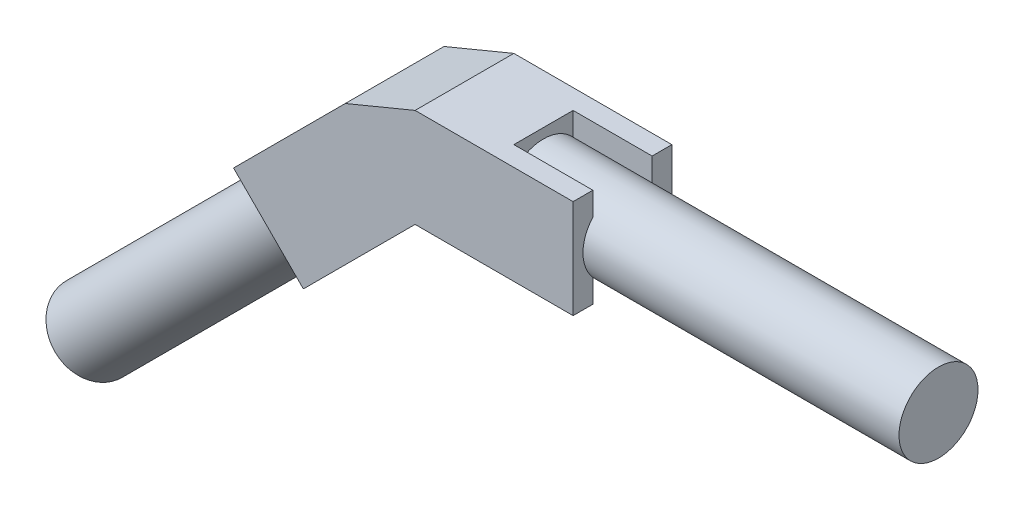
ISO-10303-21;
HEADER;
FILE_DESCRIPTION(('STEP AP214'),'2;1');
FILE_NAME('part.step','',(''),(''),'','','');
FILE_SCHEMA(('AUTOMOTIVE_DESIGN { 1 0 10303 214 1 1 1 1 }'));
ENDSEC;
DATA;
#1=APPLICATION_CONTEXT('core data for automotive mechanical design processes');
#2=APPLICATION_PROTOCOL_DEFINITION('international standard','automotive_design',2000,#1);
#3=PRODUCT_CONTEXT('',#1,'mechanical');
#4=PRODUCT('Part','Part','',(#3));
#5=PRODUCT_RELATED_PRODUCT_CATEGORY('part','',(#4));
#6=PRODUCT_DEFINITION_FORMATION('','',#4);
#7=PRODUCT_DEFINITION_CONTEXT('part definition',#1,'design');
#8=PRODUCT_DEFINITION('design','',#6,#7);
#9=PRODUCT_DEFINITION_SHAPE('','',#8);
#10=(LENGTH_UNIT() NAMED_UNIT(*) SI_UNIT(.MILLI.,.METRE.));
#11=(NAMED_UNIT(*) PLANE_ANGLE_UNIT() SI_UNIT($,.RADIAN.));
#12=(NAMED_UNIT(*) SI_UNIT($,.STERADIAN.) SOLID_ANGLE_UNIT());
#13=UNCERTAINTY_MEASURE_WITH_UNIT(LENGTH_MEASURE(1.E-05),#10,'distance_accuracy_value','');
#14=(GEOMETRIC_REPRESENTATION_CONTEXT(3) GLOBAL_UNCERTAINTY_ASSIGNED_CONTEXT((#13)) GLOBAL_UNIT_ASSIGNED_CONTEXT((#10,
#11,#12)) REPRESENTATION_CONTEXT('',''));
#15=CARTESIAN_POINT('',(0.,0.,0.));
#16=DIRECTION('',(0.,0.,1.));
#17=DIRECTION('',(1.,0.,0.));
#18=AXIS2_PLACEMENT_3D('',#15,#16,#17);
#19=CARTESIAN_POINT('',(0.,0.,0.));
#20=DIRECTION('',(-1.,0.,0.));
#21=DIRECTION('',(0.,0.,1.));
#22=AXIS2_PLACEMENT_3D('',#19,#20,#21);
#23=PLANE('',#22);
#24=DIRECTION('',(0.,0.,1.));
#25=VECTOR('',#24,1.);
#26=CARTESIAN_POINT('',(0.,-15.875,-15.875));
#27=LINE('',#26,#25);
#28=CARTESIAN_POINT('',(0.,-15.875,-9.525));
#29=VERTEX_POINT('',#28);
#30=CARTESIAN_POINT('',(0.,-15.875,9.525));
#31=VERTEX_POINT('',#30);
#32=EDGE_CURVE('E326',#29,#31,#27,.T.);
#33=ORIENTED_EDGE('',*,*,#32,.F.);
#34=DIRECTION('',(0.,1.,0.));
#35=VECTOR('',#34,1.);
#36=CARTESIAN_POINT('',(0.,15.875,-9.525));
#37=LINE('',#36,#35);
#38=CARTESIAN_POINT('',(0.,-8.40026041263008,-9.525));
#39=VERTEX_POINT('',#38);
#40=EDGE_CURVE('E269',#29,#39,#37,.T.);
#41=ORIENTED_EDGE('',*,*,#40,.T.);
#42=CARTESIAN_POINT('',(0.,0.,0.));
#43=DIRECTION('',(1.,0.,0.));
#44=DIRECTION('',(0.,0.,-1.));
#45=AXIS2_PLACEMENT_3D('',#42,#43,#44);
#46=CIRCLE('',#45,12.7);
#47=CARTESIAN_POINT('',(0.,-8.40026041263008,9.525));
#48=VERTEX_POINT('',#47);
#49=EDGE_CURVE('E343',#48,#39,#46,.T.);
#50=ORIENTED_EDGE('',*,*,#49,.F.);
#51=DIRECTION('',(0.,1.,0.));
#52=VECTOR('',#51,1.);
#53=CARTESIAN_POINT('',(0.,0.,9.525));
#54=LINE('',#53,#52);
#55=EDGE_CURVE('E342',#31,#48,#54,.T.);
#56=ORIENTED_EDGE('',*,*,#55,.F.);
#57=EDGE_LOOP('',(#33,#41,#50,#56));
#58=FACE_BOUND('',#57,.T.);
#59=ADVANCED_FACE('F39',(#58),#23,.F.);
#60=CARTESIAN_POINT('',(127.,0.,0.));
#61=DIRECTION('',(-1.,0.,0.));
#62=DIRECTION('',(0.,0.,1.));
#63=AXIS2_PLACEMENT_3D('',#60,#61,#62);
#64=CYLINDRICAL_SURFACE('',#63,12.7);
#65=CARTESIAN_POINT('',(127.,0.,0.));
#66=DIRECTION('',(1.,0.,0.));
#67=DIRECTION('',(0.,0.,-1.));
#68=AXIS2_PLACEMENT_3D('',#65,#66,#67);
#69=CIRCLE('',#68,12.7);
#70=CARTESIAN_POINT('',(127.,0.,-12.7));
#71=VERTEX_POINT('',#70);
#72=EDGE_CURVE('E339',#71,#71,#69,.T.);
#73=ORIENTED_EDGE('',*,*,#72,.F.);
#74=EDGE_LOOP('',(#73));
#75=FACE_BOUND('',#74,.T.);
#76=CARTESIAN_POINT('',(25.4,0.,0.));
#77=DIRECTION('',(1.,0.,0.));
#78=DIRECTION('',(0.,0.,-1.));
#79=AXIS2_PLACEMENT_3D('',#76,#77,#78);
#80=CIRCLE('',#79,12.7);
#81=CARTESIAN_POINT('',(25.4,-8.40026041263008,-9.525));
#82=VERTEX_POINT('',#81);
#83=CARTESIAN_POINT('',(25.4,8.40026041263007,-9.525));
#84=VERTEX_POINT('',#83);
#85=EDGE_CURVE('E11',#82,#84,#80,.T.);
#86=ORIENTED_EDGE('',*,*,#85,.T.);
#87=DIRECTION('',(-1.,0.,0.));
#88=VECTOR('',#87,1.);
#89=CARTESIAN_POINT('',(127.,8.40026041263007,-9.525));
#90=LINE('',#89,#88);
#91=CARTESIAN_POINT('',(0.,8.40026041263007,-9.525));
#92=VERTEX_POINT('',#91);
#93=EDGE_CURVE('E291',#84,#92,#90,.T.);
#94=ORIENTED_EDGE('',*,*,#93,.T.);
#95=CARTESIAN_POINT('',(0.,8.40026041263007,9.525));
#96=VERTEX_POINT('',#95);
#97=EDGE_CURVE('E338',#92,#96,#46,.T.);
#98=ORIENTED_EDGE('',*,*,#97,.T.);
#99=DIRECTION('',(-1.,0.,0.));
#100=VECTOR('',#99,1.);
#101=CARTESIAN_POINT('',(127.,8.40026041263007,9.525));
#102=LINE('',#101,#100);
#103=CARTESIAN_POINT('',(25.4,8.40026041263007,9.525));
#104=VERTEX_POINT('',#103);
#105=EDGE_CURVE('E318',#104,#96,#102,.T.);
#106=ORIENTED_EDGE('',*,*,#105,.F.);
#107=CARTESIAN_POINT('',(25.4,0.,0.));
#108=DIRECTION('',(1.,0.,0.));
#109=DIRECTION('',(0.,1.,0.));
#110=AXIS2_PLACEMENT_3D('',#107,#108,#109);
#111=CIRCLE('',#110,12.7);
#112=CARTESIAN_POINT('',(25.4,-8.40026041263008,9.525));
#113=VERTEX_POINT('',#112);
#114=EDGE_CURVE('E47',#104,#113,#111,.T.);
#115=ORIENTED_EDGE('',*,*,#114,.T.);
#116=DIRECTION('',(-1.,0.,0.));
#117=VECTOR('',#116,1.);
#118=CARTESIAN_POINT('',(127.,-8.40026041263007,9.525));
#119=LINE('',#118,#117);
#120=EDGE_CURVE('E314',#48,#113,#119,.F.);
#121=ORIENTED_EDGE('',*,*,#120,.F.);
#122=ORIENTED_EDGE('',*,*,#49,.T.);
#123=DIRECTION('',(-1.,0.,0.));
#124=VECTOR('',#123,1.);
#125=CARTESIAN_POINT('',(127.,-8.40026041263007,-9.525));
#126=LINE('',#125,#124);
#127=EDGE_CURVE('E286',#39,#82,#126,.F.);
#128=ORIENTED_EDGE('',*,*,#127,.T.);
#129=EDGE_LOOP('',(#86,#94,#98,#106,#115,#121,#122,#128));
#130=FACE_BOUND('',#129,.T.);
#131=ADVANCED_FACE('F41',(#75,#130),#64,.T.);
#132=ORIENTED_EDGE('',*,*,#97,.F.);
#133=CARTESIAN_POINT('',(0.,15.875,-9.525));
#134=VERTEX_POINT('',#133);
#135=EDGE_CURVE('E273',#92,#134,#37,.T.);
#136=ORIENTED_EDGE('',*,*,#135,.T.);
#137=DIRECTION('',(0.,0.,-1.));
#138=VECTOR('',#137,1.);
#139=CARTESIAN_POINT('',(0.,15.875,-15.875));
#140=LINE('',#139,#138);
#141=CARTESIAN_POINT('',(0.,15.875,9.525));
#142=VERTEX_POINT('',#141);
#143=EDGE_CURVE('E321',#142,#134,#140,.T.);
#144=ORIENTED_EDGE('',*,*,#143,.F.);
#145=DIRECTION('',(0.,-1.,0.));
#146=VECTOR('',#145,1.);
#147=CARTESIAN_POINT('',(0.,15.875,9.525));
#148=LINE('',#147,#146);
#149=EDGE_CURVE('E295',#142,#96,#148,.T.);
#150=ORIENTED_EDGE('',*,*,#149,.T.);
#151=EDGE_LOOP('',(#132,#136,#144,#150));
#152=FACE_BOUND('',#151,.T.);
#153=ADVANCED_FACE('F365',(#152),#23,.F.);
#154=CARTESIAN_POINT('',(127.,0.,0.));
#155=DIRECTION('',(1.,0.,0.));
#156=DIRECTION('',(0.,0.,-1.));
#157=AXIS2_PLACEMENT_3D('',#154,#155,#156);
#158=PLANE('',#157);
#159=ORIENTED_EDGE('',*,*,#72,.T.);
#160=EDGE_LOOP('',(#159));
#161=FACE_BOUND('',#160,.T.);
#162=ADVANCED_FACE('F397',(#161),#158,.T.);
#163=CARTESIAN_POINT('',(-25.4,15.875,15.875));
#164=DIRECTION('',(0.,0.,-1.));
#165=DIRECTION('',(-1.,0.,0.));
#166=AXIS2_PLACEMENT_3D('',#163,#164,#165);
#167=PLANE('',#166);
#168=DIRECTION('',(1.,0.,0.));
#169=VECTOR('',#168,1.);
#170=CARTESIAN_POINT('',(-25.4,-15.875,15.875));
#171=LINE('',#170,#169);
#172=CARTESIAN_POINT('',(-25.4,-15.875,15.875));
#173=VERTEX_POINT('',#172);
#174=CARTESIAN_POINT('',(25.4,-15.875,15.875));
#175=VERTEX_POINT('',#174);
#176=EDGE_CURVE('E328',#173,#175,#171,.T.);
#177=ORIENTED_EDGE('',*,*,#176,.T.);
#178=DIRECTION('',(0.,1.,0.));
#179=VECTOR('',#178,1.);
#180=CARTESIAN_POINT('',(25.4,15.875,15.875));
#181=LINE('',#180,#179);
#182=CARTESIAN_POINT('',(25.4,15.875,15.875));
#183=VERTEX_POINT('',#182);
#184=EDGE_CURVE('E294',#175,#183,#181,.T.);
#185=ORIENTED_EDGE('',*,*,#184,.T.);
#186=DIRECTION('',(1.,0.,0.));
#187=VECTOR('',#186,1.);
#188=CARTESIAN_POINT('',(-25.4,15.875,15.875));
#189=LINE('',#188,#187);
#190=CARTESIAN_POINT('',(-25.4,15.875,15.875));
#191=VERTEX_POINT('',#190);
#192=EDGE_CURVE('E336',#191,#183,#189,.T.);
#193=ORIENTED_EDGE('',*,*,#192,.F.);
#194=DIRECTION('',(0.923879532511286,0.382683432365091,0.));
#195=VECTOR('',#194,1.);
#196=CARTESIAN_POINT('',(-25.4,15.875,15.875));
#197=LINE('',#196,#195);
#198=CARTESIAN_POINT('',(-47.8506403026729,6.57564030267284,15.875));
#199=VERTEX_POINT('',#198);
#200=EDGE_CURVE('E260',#199,#191,#197,.T.);
#201=ORIENTED_EDGE('',*,*,#200,.F.);
#202=DIRECTION('',(0.707106781186546,0.707106781186549,0.));
#203=VECTOR('',#202,1.);
#204=CARTESIAN_POINT('',(-65.8111525448112,-11.3848719394655,15.875));
#205=LINE('',#204,#203);
#206=CARTESIAN_POINT('',(-83.7716647869495,-29.3453841816038,15.875));
#207=VERTEX_POINT('',#206);
#208=EDGE_CURVE('E227',#207,#199,#205,.T.);
#209=ORIENTED_EDGE('',*,*,#208,.F.);
#210=DIRECTION('',(0.707106781186547,-0.707106781186548,0.));
#211=VECTOR('',#210,1.);
#212=CARTESIAN_POINT('',(-61.3210244842766,-51.7960244842767,15.875));
#213=LINE('',#212,#211);
#214=CARTESIAN_POINT('',(-61.3210244842766,-51.7960244842767,15.875));
#215=VERTEX_POINT('',#214);
#216=EDGE_CURVE('E791',#207,#215,#213,.T.);
#217=ORIENTED_EDGE('',*,*,#216,.T.);
#218=DIRECTION('',(0.707106781186546,0.707106781186549,0.));
#219=VECTOR('',#218,1.);
#220=CARTESIAN_POINT('',(-43.3605122421383,-33.8355122421383,15.875));
#221=LINE('',#220,#219);
#222=EDGE_CURVE('E236',#215,#173,#221,.T.);
#223=ORIENTED_EDGE('',*,*,#222,.T.);
#224=EDGE_LOOP('',(#177,#185,#193,#201,#209,#217,#223));
#225=FACE_BOUND('',#224,.T.);
#226=ADVANCED_FACE('F401',(#225),#167,.F.);
#227=CARTESIAN_POINT('',(-25.4,15.875,-15.875));
#228=DIRECTION('',(0.,-1.,0.));
#229=DIRECTION('',(0.,0.,-1.));
#230=AXIS2_PLACEMENT_3D('',#227,#228,#229);
#231=PLANE('',#230);
#232=ORIENTED_EDGE('',*,*,#192,.T.);
#233=DIRECTION('',(0.,0.,1.));
#234=VECTOR('',#233,1.);
#235=CARTESIAN_POINT('',(25.4,15.875,9.525));
#236=LINE('',#235,#234);
#237=CARTESIAN_POINT('',(25.4,15.875,9.525));
#238=VERTEX_POINT('',#237);
#239=EDGE_CURVE('E311',#238,#183,#236,.T.);
#240=ORIENTED_EDGE('',*,*,#239,.F.);
#241=DIRECTION('',(-1.,0.,0.));
#242=VECTOR('',#241,1.);
#243=CARTESIAN_POINT('',(0.,15.875,9.525));
#244=LINE('',#243,#242);
#245=EDGE_CURVE('E305',#238,#142,#244,.T.);
#246=ORIENTED_EDGE('',*,*,#245,.T.);
#247=ORIENTED_EDGE('',*,*,#143,.T.);
#248=DIRECTION('',(1.,0.,0.));
#249=VECTOR('',#248,1.);
#250=CARTESIAN_POINT('',(0.,15.875,-9.525));
#251=LINE('',#250,#249);
#252=CARTESIAN_POINT('',(25.4,15.875,-9.525));
#253=VERTEX_POINT('',#252);
#254=EDGE_CURVE('E272',#134,#253,#251,.T.);
#255=ORIENTED_EDGE('',*,*,#254,.T.);
#256=DIRECTION('',(0.,0.,-1.));
#257=VECTOR('',#256,1.);
#258=CARTESIAN_POINT('',(25.4,15.875,-9.525));
#259=LINE('',#258,#257);
#260=CARTESIAN_POINT('',(25.4,15.875,-15.875));
#261=VERTEX_POINT('',#260);
#262=EDGE_CURVE('E281',#253,#261,#259,.T.);
#263=ORIENTED_EDGE('',*,*,#262,.T.);
#264=DIRECTION('',(1.,0.,0.));
#265=VECTOR('',#264,1.);
#266=CARTESIAN_POINT('',(-25.4,15.875,-15.875));
#267=LINE('',#266,#265);
#268=CARTESIAN_POINT('',(-25.4,15.875,-15.875));
#269=VERTEX_POINT('',#268);
#270=EDGE_CURVE('E334',#269,#261,#267,.T.);
#271=ORIENTED_EDGE('',*,*,#270,.F.);
#272=DIRECTION('',(0.,0.,-1.));
#273=VECTOR('',#272,1.);
#274=CARTESIAN_POINT('',(-25.4,15.875,-15.875));
#275=LINE('',#274,#273);
#276=EDGE_CURVE('E322',#191,#269,#275,.T.);
#277=ORIENTED_EDGE('',*,*,#276,.F.);
#278=EDGE_LOOP('',(#232,#240,#246,#247,#255,#263,#271,#277));
#279=FACE_BOUND('',#278,.T.);
#280=ADVANCED_FACE('F361',(#279),#231,.F.);
#281=CARTESIAN_POINT('',(-25.4,15.875,-15.875));
#282=DIRECTION('',(0.,0.,1.));
#283=DIRECTION('',(1.,0.,0.));
#284=AXIS2_PLACEMENT_3D('',#281,#282,#283);
#285=PLANE('',#284);
#286=ORIENTED_EDGE('',*,*,#270,.T.);
#287=DIRECTION('',(0.,-1.,0.));
#288=VECTOR('',#287,1.);
#289=CARTESIAN_POINT('',(25.4,15.875,-15.875));
#290=LINE('',#289,#288);
#291=CARTESIAN_POINT('',(25.4,-15.875,-15.875));
#292=VERTEX_POINT('',#291);
#293=EDGE_CURVE('E268',#261,#292,#290,.T.);
#294=ORIENTED_EDGE('',*,*,#293,.T.);
#295=DIRECTION('',(1.,0.,0.));
#296=VECTOR('',#295,1.);
#297=CARTESIAN_POINT('',(-25.4,-15.875,-15.875));
#298=LINE('',#297,#296);
#299=CARTESIAN_POINT('',(-25.4,-15.875,-15.875));
#300=VERTEX_POINT('',#299);
#301=EDGE_CURVE('E62',#300,#292,#298,.T.);
#302=ORIENTED_EDGE('',*,*,#301,.F.);
#303=DIRECTION('',(0.707106781186546,0.707106781186549,0.));
#304=VECTOR('',#303,1.);
#305=CARTESIAN_POINT('',(-43.3605122421383,-33.8355122421383,-15.875));
#306=LINE('',#305,#304);
#307=CARTESIAN_POINT('',(-61.3210244842766,-51.7960244842767,-15.875));
#308=VERTEX_POINT('',#307);
#309=EDGE_CURVE('E233',#308,#300,#306,.T.);
#310=ORIENTED_EDGE('',*,*,#309,.F.);
#311=DIRECTION('',(-0.707106781186547,0.707106781186548,0.));
#312=VECTOR('',#311,1.);
#313=CARTESIAN_POINT('',(-83.7716647869495,-29.3453841816038,-15.875));
#314=LINE('',#313,#312);
#315=CARTESIAN_POINT('',(-83.7716647869495,-29.3453841816038,-15.875));
#316=VERTEX_POINT('',#315);
#317=EDGE_CURVE('E215',#308,#316,#314,.T.);
#318=ORIENTED_EDGE('',*,*,#317,.T.);
#319=DIRECTION('',(0.707106781186546,0.707106781186549,0.));
#320=VECTOR('',#319,1.);
#321=CARTESIAN_POINT('',(-65.8111525448112,-11.3848719394655,-15.875));
#322=LINE('',#321,#320);
#323=CARTESIAN_POINT('',(-47.8506403026729,6.57564030267284,-15.875));
#324=VERTEX_POINT('',#323);
#325=EDGE_CURVE('E223',#316,#324,#322,.T.);
#326=ORIENTED_EDGE('',*,*,#325,.T.);
#327=DIRECTION('',(0.923879532511286,0.382683432365091,0.));
#328=VECTOR('',#327,1.);
#329=CARTESIAN_POINT('',(-25.4,15.875,-15.875));
#330=LINE('',#329,#328);
#331=EDGE_CURVE('E259',#324,#269,#330,.T.);
#332=ORIENTED_EDGE('',*,*,#331,.T.);
#333=EDGE_LOOP('',(#286,#294,#302,#310,#318,#326,#332));
#334=FACE_BOUND('',#333,.T.);
#335=ADVANCED_FACE('F411',(#334),#285,.F.);
#336=CARTESIAN_POINT('',(-25.4,-15.875,-15.875));
#337=DIRECTION('',(0.,1.,0.));
#338=DIRECTION('',(0.,0.,1.));
#339=AXIS2_PLACEMENT_3D('',#336,#337,#338);
#340=PLANE('',#339);
#341=ORIENTED_EDGE('',*,*,#301,.T.);
#342=DIRECTION('',(0.,0.,-1.));
#343=VECTOR('',#342,1.);
#344=CARTESIAN_POINT('',(25.4,-15.875,-9.525));
#345=LINE('',#344,#343);
#346=CARTESIAN_POINT('',(25.4,-15.875,-9.525));
#347=VERTEX_POINT('',#346);
#348=EDGE_CURVE('E283',#347,#292,#345,.T.);
#349=ORIENTED_EDGE('',*,*,#348,.F.);
#350=DIRECTION('',(-1.,0.,0.));
#351=VECTOR('',#350,1.);
#352=CARTESIAN_POINT('',(0.,-15.875,-9.525));
#353=LINE('',#352,#351);
#354=EDGE_CURVE('E54',#347,#29,#353,.T.);
#355=ORIENTED_EDGE('',*,*,#354,.T.);
#356=ORIENTED_EDGE('',*,*,#32,.T.);
#357=DIRECTION('',(1.,0.,0.));
#358=VECTOR('',#357,1.);
#359=CARTESIAN_POINT('',(0.,-15.875,9.525));
#360=LINE('',#359,#358);
#361=CARTESIAN_POINT('',(25.4,-15.875,9.525));
#362=VERTEX_POINT('',#361);
#363=EDGE_CURVE('E298',#31,#362,#360,.T.);
#364=ORIENTED_EDGE('',*,*,#363,.T.);
#365=DIRECTION('',(0.,0.,1.));
#366=VECTOR('',#365,1.);
#367=CARTESIAN_POINT('',(25.4,-15.875,9.525));
#368=LINE('',#367,#366);
#369=EDGE_CURVE('E308',#362,#175,#368,.T.);
#370=ORIENTED_EDGE('',*,*,#369,.T.);
#371=ORIENTED_EDGE('',*,*,#176,.F.);
#372=DIRECTION('',(0.,0.,1.));
#373=VECTOR('',#372,1.);
#374=CARTESIAN_POINT('',(-25.4,-15.875,-15.875));
#375=LINE('',#374,#373);
#376=EDGE_CURVE('E325',#300,#173,#375,.T.);
#377=ORIENTED_EDGE('',*,*,#376,.F.);
#378=EDGE_LOOP('',(#341,#349,#355,#356,#364,#370,#371,#377));
#379=FACE_BOUND('',#378,.T.);
#380=ADVANCED_FACE('F378',(#379),#340,.F.);
#381=CARTESIAN_POINT('',(0.,0.,9.525));
#382=DIRECTION('',(0.,0.,1.));
#383=DIRECTION('',(1.,0.,0.));
#384=AXIS2_PLACEMENT_3D('',#381,#382,#383);
#385=PLANE('',#384);
#386=DIRECTION('',(0.,1.,0.));
#387=VECTOR('',#386,1.);
#388=CARTESIAN_POINT('',(25.4,15.875,9.525));
#389=LINE('',#388,#387);
#390=EDGE_CURVE('E301',#104,#238,#389,.T.);
#391=ORIENTED_EDGE('',*,*,#390,.F.);
#392=ORIENTED_EDGE('',*,*,#105,.T.);
#393=ORIENTED_EDGE('',*,*,#149,.F.);
#394=ORIENTED_EDGE('',*,*,#245,.F.);
#395=EDGE_LOOP('',(#391,#392,#393,#394));
#396=FACE_BOUND('',#395,.T.);
#397=ADVANCED_FACE('F358',(#396),#385,.F.);
#398=ORIENTED_EDGE('',*,*,#55,.T.);
#399=ORIENTED_EDGE('',*,*,#120,.T.);
#400=EDGE_CURVE('E302',#362,#113,#389,.T.);
#401=ORIENTED_EDGE('',*,*,#400,.F.);
#402=ORIENTED_EDGE('',*,*,#363,.F.);
#403=EDGE_LOOP('',(#398,#399,#401,#402));
#404=FACE_BOUND('',#403,.T.);
#405=ADVANCED_FACE('F380',(#404),#385,.F.);
#406=CARTESIAN_POINT('',(25.4,15.875,9.525));
#407=DIRECTION('',(1.,0.,0.));
#408=DIRECTION('',(0.,1.,0.));
#409=AXIS2_PLACEMENT_3D('',#406,#407,#408);
#410=PLANE('',#409);
#411=ORIENTED_EDGE('',*,*,#114,.F.);
#412=ORIENTED_EDGE('',*,*,#390,.T.);
#413=ORIENTED_EDGE('',*,*,#239,.T.);
#414=ORIENTED_EDGE('',*,*,#184,.F.);
#415=ORIENTED_EDGE('',*,*,#369,.F.);
#416=ORIENTED_EDGE('',*,*,#400,.T.);
#417=EDGE_LOOP('',(#411,#412,#413,#414,#415,#416));
#418=FACE_BOUND('',#417,.T.);
#419=ADVANCED_FACE('F353',(#418),#410,.T.);
#420=CARTESIAN_POINT('',(0.,0.,-9.525));
#421=DIRECTION('',(0.,0.,1.));
#422=DIRECTION('',(1.,0.,0.));
#423=AXIS2_PLACEMENT_3D('',#420,#421,#422);
#424=PLANE('',#423);
#425=ORIENTED_EDGE('',*,*,#93,.F.);
#426=DIRECTION('',(0.,-1.,0.));
#427=VECTOR('',#426,1.);
#428=CARTESIAN_POINT('',(25.4,15.875,-9.525));
#429=LINE('',#428,#427);
#430=EDGE_CURVE('E277',#253,#84,#429,.T.);
#431=ORIENTED_EDGE('',*,*,#430,.F.);
#432=ORIENTED_EDGE('',*,*,#254,.F.);
#433=ORIENTED_EDGE('',*,*,#135,.F.);
#434=EDGE_LOOP('',(#425,#431,#432,#433));
#435=FACE_BOUND('',#434,.T.);
#436=ADVANCED_FACE('F367',(#435),#424,.T.);
#437=ORIENTED_EDGE('',*,*,#127,.F.);
#438=ORIENTED_EDGE('',*,*,#40,.F.);
#439=ORIENTED_EDGE('',*,*,#354,.F.);
#440=EDGE_CURVE('E276',#82,#347,#429,.T.);
#441=ORIENTED_EDGE('',*,*,#440,.F.);
#442=EDGE_LOOP('',(#437,#438,#439,#441));
#443=FACE_BOUND('',#442,.T.);
#444=ADVANCED_FACE('F373',(#443),#424,.T.);
#445=CARTESIAN_POINT('',(25.4,15.875,-9.525));
#446=DIRECTION('',(1.,0.,0.));
#447=DIRECTION('',(0.,0.,-1.));
#448=AXIS2_PLACEMENT_3D('',#445,#446,#447);
#449=PLANE('',#448);
#450=ORIENTED_EDGE('',*,*,#85,.F.);
#451=ORIENTED_EDGE('',*,*,#440,.T.);
#452=ORIENTED_EDGE('',*,*,#348,.T.);
#453=ORIENTED_EDGE('',*,*,#293,.F.);
#454=ORIENTED_EDGE('',*,*,#262,.F.);
#455=ORIENTED_EDGE('',*,*,#430,.T.);
#456=EDGE_LOOP('',(#450,#451,#452,#453,#454,#455));
#457=FACE_BOUND('',#456,.T.);
#458=ADVANCED_FACE('F371',(#457),#449,.T.);
#459=CARTESIAN_POINT('',(-25.4,15.875,15.875));
#460=DIRECTION('',(-0.382683432365091,0.923879532511286,0.));
#461=DIRECTION('',(-0.923879532511287,-0.382683432365091,0.));
#462=AXIS2_PLACEMENT_3D('',#459,#460,#461);
#463=PLANE('',#462);
#464=ORIENTED_EDGE('',*,*,#331,.F.);
#465=DIRECTION('',(0.,0.,-1.));
#466=VECTOR('',#465,1.);
#467=CARTESIAN_POINT('',(-47.8506403026729,6.57564030267284,15.875));
#468=LINE('',#467,#466);
#469=EDGE_CURVE('E263',#199,#324,#468,.T.);
#470=ORIENTED_EDGE('',*,*,#469,.F.);
#471=ORIENTED_EDGE('',*,*,#200,.T.);
#472=ORIENTED_EDGE('',*,*,#276,.T.);
#473=EDGE_LOOP('',(#464,#470,#471,#472));
#474=FACE_BOUND('',#473,.T.);
#475=ADVANCED_FACE('F459',(#474),#463,.T.);
#476=CARTESIAN_POINT('',(-38.5980122421382,-38.5980122421384,0.));
#477=DIRECTION('',(0.707106781186546,0.707106781186549,0.));
#478=DIRECTION('',(-0.707106781186549,0.707106781186546,0.));
#479=AXIS2_PLACEMENT_3D('',#476,#477,#478);
#480=PLANE('',#479);
#481=DIRECTION('',(0.,0.,1.));
#482=VECTOR('',#481,1.);
#483=CARTESIAN_POINT('',(-65.8111525448112,-11.3848719394655,-15.875));
#484=LINE('',#483,#482);
#485=CARTESIAN_POINT('',(-65.8111525448112,-11.3848719394655,-9.525));
#486=VERTEX_POINT('',#485);
#487=CARTESIAN_POINT('',(-65.8111525448112,-11.3848719394655,9.525));
#488=VERTEX_POINT('',#487);
#489=EDGE_CURVE('E224',#486,#488,#484,.T.);
#490=ORIENTED_EDGE('',*,*,#489,.F.);
#491=DIRECTION('',(0.707106781186549,-0.707106781186546,0.));
#492=VECTOR('',#491,1.);
#493=CARTESIAN_POINT('',(-43.3605122421383,-33.8355122421383,-9.525));
#494=LINE('',#493,#492);
#495=CARTESIAN_POINT('',(-60.5257134949784,-16.6703109892983,-9.525));
#496=VERTEX_POINT('',#495);
#497=EDGE_CURVE('E206',#486,#496,#494,.T.);
#498=ORIENTED_EDGE('',*,*,#497,.T.);
#499=CARTESIAN_POINT('',(-54.5858323934747,-22.6101920908019,0.));
#500=DIRECTION('',(-0.707106781186546,-0.707106781186549,0.));
#501=DIRECTION('',(0.707106781186549,-0.707106781186546,0.));
#502=AXIS2_PLACEMENT_3D('',#499,#500,#501);
#503=CIRCLE('',#502,12.7);
#504=CARTESIAN_POINT('',(-60.5257134949784,-16.6703109892983,9.525));
#505=VERTEX_POINT('',#504);
#506=EDGE_CURVE('E245',#505,#496,#503,.T.);
#507=ORIENTED_EDGE('',*,*,#506,.F.);
#508=DIRECTION('',(-0.707106781186549,0.707106781186546,0.));
#509=VECTOR('',#508,1.);
#510=CARTESIAN_POINT('',(-65.8111525448112,-11.3848719394655,9.525));
#511=LINE('',#510,#509);
#512=EDGE_CURVE('E796',#505,#488,#511,.T.);
#513=ORIENTED_EDGE('',*,*,#512,.T.);
#514=EDGE_LOOP('',(#490,#498,#507,#513));
#515=FACE_BOUND('',#514,.T.);
#516=ADVANCED_FACE('F468',(#515),#480,.F.);
#517=CARTESIAN_POINT('',(-43.3605122421383,-33.8355122421383,-15.875));
#518=DIRECTION('',(-0.707106781186549,0.707106781186546,0.));
#519=DIRECTION('',(-0.707106781186546,-0.707106781186549,0.));
#520=AXIS2_PLACEMENT_3D('',#517,#518,#519);
#521=PLANE('',#520);
#522=ORIENTED_EDGE('',*,*,#376,.T.);
#523=ORIENTED_EDGE('',*,*,#222,.F.);
#524=DIRECTION('',(0.,0.,1.));
#525=VECTOR('',#524,1.);
#526=CARTESIAN_POINT('',(-61.3210244842766,-51.7960244842767,9.525));
#527=LINE('',#526,#525);
#528=CARTESIAN_POINT('',(-61.3210244842766,-51.7960244842767,9.525));
#529=VERTEX_POINT('',#528);
#530=EDGE_CURVE('E807',#529,#215,#527,.T.);
#531=ORIENTED_EDGE('',*,*,#530,.F.);
#532=DIRECTION('',(0.707106781186548,0.707106781186548,0.));
#533=VECTOR('',#532,1.);
#534=CARTESIAN_POINT('',(-43.3605122421383,-33.8355122421383,9.525));
#535=LINE('',#534,#533);
#536=CARTESIAN_POINT('',(-43.3605122421383,-33.8355122421383,9.525));
#537=VERTEX_POINT('',#536);
#538=EDGE_CURVE('E222',#529,#537,#535,.T.);
#539=ORIENTED_EDGE('',*,*,#538,.T.);
#540=DIRECTION('',(0.,0.,1.));
#541=VECTOR('',#540,1.);
#542=CARTESIAN_POINT('',(-43.3605122421383,-33.8355122421383,-15.875));
#543=LINE('',#542,#541);
#544=CARTESIAN_POINT('',(-43.3605122421383,-33.8355122421383,-9.525));
#545=VERTEX_POINT('',#544);
#546=EDGE_CURVE('E212',#545,#537,#543,.T.);
#547=ORIENTED_EDGE('',*,*,#546,.F.);
#548=DIRECTION('',(-0.707106781186548,-0.707106781186548,0.));
#549=VECTOR('',#548,1.);
#550=CARTESIAN_POINT('',(-61.3210244842766,-51.7960244842767,-9.525));
#551=LINE('',#550,#549);
#552=CARTESIAN_POINT('',(-61.3210244842766,-51.7960244842767,-9.525));
#553=VERTEX_POINT('',#552);
#554=EDGE_CURVE('E195',#545,#553,#551,.T.);
#555=ORIENTED_EDGE('',*,*,#554,.T.);
#556=DIRECTION('',(0.,0.,-1.));
#557=VECTOR('',#556,1.);
#558=CARTESIAN_POINT('',(-61.3210244842766,-51.7960244842767,-9.525));
#559=LINE('',#558,#557);
#560=EDGE_CURVE('E786',#553,#308,#559,.T.);
#561=ORIENTED_EDGE('',*,*,#560,.T.);
#562=ORIENTED_EDGE('',*,*,#309,.T.);
#563=EDGE_LOOP('',(#522,#523,#531,#539,#547,#555,#561,#562));
#564=FACE_BOUND('',#563,.T.);
#565=ADVANCED_FACE('F219',(#564),#521,.F.);
#566=CARTESIAN_POINT('',(-65.8111525448112,-11.3848719394655,-15.875));
#567=DIRECTION('',(-0.707106781186549,0.707106781186546,0.));
#568=DIRECTION('',(-0.707106781186546,-0.707106781186549,0.));
#569=AXIS2_PLACEMENT_3D('',#566,#567,#568);
#570=PLANE('',#569);
#571=ORIENTED_EDGE('',*,*,#469,.T.);
#572=ORIENTED_EDGE('',*,*,#325,.F.);
#573=DIRECTION('',(0.,0.,-1.));
#574=VECTOR('',#573,1.);
#575=CARTESIAN_POINT('',(-83.7716647869495,-29.3453841816038,-9.525));
#576=LINE('',#575,#574);
#577=CARTESIAN_POINT('',(-83.7716647869495,-29.3453841816038,-9.525));
#578=VERTEX_POINT('',#577);
#579=EDGE_CURVE('E789',#578,#316,#576,.T.);
#580=ORIENTED_EDGE('',*,*,#579,.F.);
#581=DIRECTION('',(0.707106781186547,0.707106781186548,0.));
#582=VECTOR('',#581,1.);
#583=CARTESIAN_POINT('',(-65.8111525448112,-11.3848719394655,-9.525));
#584=LINE('',#583,#582);
#585=EDGE_CURVE('E784',#578,#486,#584,.T.);
#586=ORIENTED_EDGE('',*,*,#585,.T.);
#587=ORIENTED_EDGE('',*,*,#489,.T.);
#588=DIRECTION('',(-0.707106781186547,-0.707106781186548,0.));
#589=VECTOR('',#588,1.);
#590=CARTESIAN_POINT('',(-83.7716647869495,-29.3453841816038,9.525));
#591=LINE('',#590,#589);
#592=CARTESIAN_POINT('',(-83.7716647869495,-29.3453841816038,9.525));
#593=VERTEX_POINT('',#592);
#594=EDGE_CURVE('E795',#488,#593,#591,.T.);
#595=ORIENTED_EDGE('',*,*,#594,.T.);
#596=DIRECTION('',(0.,0.,1.));
#597=VECTOR('',#596,1.);
#598=CARTESIAN_POINT('',(-83.7716647869495,-29.3453841816038,9.525));
#599=LINE('',#598,#597);
#600=EDGE_CURVE('E804',#593,#207,#599,.T.);
#601=ORIENTED_EDGE('',*,*,#600,.T.);
#602=ORIENTED_EDGE('',*,*,#208,.T.);
#603=EDGE_LOOP('',(#571,#572,#580,#586,#587,#595,#601,#602));
#604=FACE_BOUND('',#603,.T.);
#605=ADVANCED_FACE('F487',(#604),#570,.T.);
#606=CARTESIAN_POINT('',(-48.6459512919711,-28.5500731923056,-9.525));
#607=VERTEX_POINT('',#606);
#608=CARTESIAN_POINT('',(-48.6459512919711,-28.5500731923056,9.525));
#609=VERTEX_POINT('',#608);
#610=EDGE_CURVE('E214',#607,#609,#503,.T.);
#611=ORIENTED_EDGE('',*,*,#610,.F.);
#612=EDGE_CURVE('E198',#607,#545,#494,.T.);
#613=ORIENTED_EDGE('',*,*,#612,.T.);
#614=ORIENTED_EDGE('',*,*,#546,.T.);
#615=EDGE_CURVE('E793',#537,#609,#511,.T.);
#616=ORIENTED_EDGE('',*,*,#615,.T.);
#617=EDGE_LOOP('',(#611,#613,#614,#616));
#618=FACE_BOUND('',#617,.T.);
#619=ADVANCED_FACE('F210',(#618),#480,.F.);
#620=CARTESIAN_POINT('',(-144.388393604166,-112.412753301494,0.));
#621=DIRECTION('',(0.707106781186546,0.707106781186549,0.));
#622=DIRECTION('',(-0.707106781186549,0.707106781186546,0.));
#623=AXIS2_PLACEMENT_3D('',#620,#621,#622);
#624=CYLINDRICAL_SURFACE('',#623,12.7);
#625=CARTESIAN_POINT('',(-144.388393604166,-112.412753301494,0.));
#626=DIRECTION('',(-0.707106781186546,-0.707106781186549,0.));
#627=DIRECTION('',(0.707106781186549,-0.707106781186546,0.));
#628=AXIS2_PLACEMENT_3D('',#625,#626,#627);
#629=CIRCLE('',#628,12.7);
#630=CARTESIAN_POINT('',(-135.408137483097,-121.393009422563,0.));
#631=VERTEX_POINT('',#630);
#632=EDGE_CURVE('E229',#631,#631,#629,.T.);
#633=ORIENTED_EDGE('',*,*,#632,.F.);
#634=EDGE_LOOP('',(#633));
#635=FACE_BOUND('',#634,.T.);
#636=CARTESIAN_POINT('',(-72.546344635613,-40.5707043329403,0.));
#637=DIRECTION('',(-0.707106781186548,-0.707106781186547,0.));
#638=DIRECTION('',(0.707106781186547,-0.707106781186548,0.));
#639=AXIS2_PLACEMENT_3D('',#636,#637,#638);
#640=CIRCLE('',#639,12.7);
#641=CARTESIAN_POINT('',(-78.4862257371166,-34.6308232314366,-9.525));
#642=VERTEX_POINT('',#641);
#643=CARTESIAN_POINT('',(-66.6064635341094,-46.5105854344439,-9.525));
#644=VERTEX_POINT('',#643);
#645=EDGE_CURVE('E254',#642,#644,#640,.T.);
#646=ORIENTED_EDGE('',*,*,#645,.T.);
#647=DIRECTION('',(0.707106781186546,0.707106781186549,0.));
#648=VECTOR('',#647,1.);
#649=CARTESIAN_POINT('',(-138.448512502662,-118.352634402997,-9.525));
#650=LINE('',#649,#648);
#651=EDGE_CURVE('E257',#644,#607,#650,.T.);
#652=ORIENTED_EDGE('',*,*,#651,.T.);
#653=ORIENTED_EDGE('',*,*,#610,.T.);
#654=DIRECTION('',(0.707106781186546,0.707106781186549,0.));
#655=VECTOR('',#654,1.);
#656=CARTESIAN_POINT('',(-138.448512502662,-118.352634402997,9.525));
#657=LINE('',#656,#655);
#658=CARTESIAN_POINT('',(-66.6064635341093,-46.5105854344439,9.525));
#659=VERTEX_POINT('',#658);
#660=EDGE_CURVE('E241',#609,#659,#657,.F.);
#661=ORIENTED_EDGE('',*,*,#660,.T.);
#662=CARTESIAN_POINT('',(-72.546344635613,-40.5707043329403,0.));
#663=DIRECTION('',(-0.707106781186548,-0.707106781186547,0.));
#664=DIRECTION('',(0.707106781186547,-0.707106781186548,0.));
#665=AXIS2_PLACEMENT_3D('',#662,#663,#664);
#666=CIRCLE('',#665,12.7);
#667=CARTESIAN_POINT('',(-78.4862257371166,-34.6308232314366,9.525));
#668=VERTEX_POINT('',#667);
#669=EDGE_CURVE('E244',#659,#668,#666,.T.);
#670=ORIENTED_EDGE('',*,*,#669,.T.);
#671=DIRECTION('',(0.707106781186546,0.707106781186549,0.));
#672=VECTOR('',#671,1.);
#673=CARTESIAN_POINT('',(-150.32827470567,-106.47287219999,9.525));
#674=LINE('',#673,#672);
#675=EDGE_CURVE('E248',#668,#505,#674,.T.);
#676=ORIENTED_EDGE('',*,*,#675,.T.);
#677=ORIENTED_EDGE('',*,*,#506,.T.);
#678=DIRECTION('',(0.707106781186546,0.707106781186549,0.));
#679=VECTOR('',#678,1.);
#680=CARTESIAN_POINT('',(-150.32827470567,-106.47287219999,-9.525));
#681=LINE('',#680,#679);
#682=EDGE_CURVE('E251',#496,#642,#681,.F.);
#683=ORIENTED_EDGE('',*,*,#682,.T.);
#684=EDGE_LOOP('',(#646,#652,#653,#661,#670,#676,#677,#683));
#685=FACE_BOUND('',#684,.T.);
#686=ADVANCED_FACE('F505',(#635,#685),#624,.T.);
#687=CARTESIAN_POINT('',(-144.388393604166,-112.412753301494,0.));
#688=DIRECTION('',(-0.707106781186546,-0.707106781186549,0.));
#689=DIRECTION('',(0.707106781186549,-0.707106781186546,0.));
#690=AXIS2_PLACEMENT_3D('',#687,#688,#689);
#691=PLANE('',#690);
#692=ORIENTED_EDGE('',*,*,#632,.T.);
#693=EDGE_LOOP('',(#692));
#694=FACE_BOUND('',#693,.T.);
#695=ADVANCED_FACE('F513',(#694),#691,.T.);
#696=CARTESIAN_POINT('',(0.,0.,9.525));
#697=DIRECTION('',(0.,0.,-1.));
#698=DIRECTION('',(-1.,0.,0.));
#699=AXIS2_PLACEMENT_3D('',#696,#697,#698);
#700=PLANE('',#699);
#701=ORIENTED_EDGE('',*,*,#675,.F.);
#702=DIRECTION('',(0.707106781186547,-0.707106781186548,0.));
#703=VECTOR('',#702,1.);
#704=CARTESIAN_POINT('',(-61.3210244842766,-51.7960244842767,9.525));
#705=LINE('',#704,#703);
#706=EDGE_CURVE('E800',#593,#668,#705,.T.);
#707=ORIENTED_EDGE('',*,*,#706,.F.);
#708=ORIENTED_EDGE('',*,*,#594,.F.);
#709=ORIENTED_EDGE('',*,*,#512,.F.);
#710=EDGE_LOOP('',(#701,#707,#708,#709));
#711=FACE_BOUND('',#710,.T.);
#712=ADVANCED_FACE('F523',(#711),#700,.T.);
#713=ORIENTED_EDGE('',*,*,#660,.F.);
#714=ORIENTED_EDGE('',*,*,#615,.F.);
#715=ORIENTED_EDGE('',*,*,#538,.F.);
#716=EDGE_CURVE('E799',#659,#529,#705,.T.);
#717=ORIENTED_EDGE('',*,*,#716,.F.);
#718=EDGE_LOOP('',(#713,#714,#715,#717));
#719=FACE_BOUND('',#718,.T.);
#720=ADVANCED_FACE('F533',(#719),#700,.T.);
#721=CARTESIAN_POINT('',(-61.3210244842766,-51.7960244842767,9.525));
#722=DIRECTION('',(-0.707106781186548,-0.707106781186547,0.));
#723=DIRECTION('',(0.707106781186547,-0.707106781186548,0.));
#724=AXIS2_PLACEMENT_3D('',#721,#722,#723);
#725=PLANE('',#724);
#726=ORIENTED_EDGE('',*,*,#669,.F.);
#727=ORIENTED_EDGE('',*,*,#716,.T.);
#728=ORIENTED_EDGE('',*,*,#530,.T.);
#729=ORIENTED_EDGE('',*,*,#216,.F.);
#730=ORIENTED_EDGE('',*,*,#600,.F.);
#731=ORIENTED_EDGE('',*,*,#706,.T.);
#732=EDGE_LOOP('',(#726,#727,#728,#729,#730,#731));
#733=FACE_BOUND('',#732,.T.);
#734=ADVANCED_FACE('F543',(#733),#725,.T.);
#735=CARTESIAN_POINT('',(0.,0.,-9.525));
#736=DIRECTION('',(0.,0.,1.));
#737=DIRECTION('',(1.,0.,0.));
#738=AXIS2_PLACEMENT_3D('',#735,#736,#737);
#739=PLANE('',#738);
#740=ORIENTED_EDGE('',*,*,#651,.F.);
#741=DIRECTION('',(-0.707106781186547,0.707106781186548,0.));
#742=VECTOR('',#741,1.);
#743=CARTESIAN_POINT('',(-83.7716647869495,-29.3453841816038,-9.525));
#744=LINE('',#743,#742);
#745=EDGE_CURVE('E201',#553,#644,#744,.T.);
#746=ORIENTED_EDGE('',*,*,#745,.F.);
#747=ORIENTED_EDGE('',*,*,#554,.F.);
#748=ORIENTED_EDGE('',*,*,#612,.F.);
#749=EDGE_LOOP('',(#740,#746,#747,#748));
#750=FACE_BOUND('',#749,.T.);
#751=ADVANCED_FACE('F197',(#750),#739,.T.);
#752=ORIENTED_EDGE('',*,*,#682,.F.);
#753=ORIENTED_EDGE('',*,*,#497,.F.);
#754=ORIENTED_EDGE('',*,*,#585,.F.);
#755=EDGE_CURVE('E205',#642,#578,#744,.T.);
#756=ORIENTED_EDGE('',*,*,#755,.F.);
#757=EDGE_LOOP('',(#752,#753,#754,#756));
#758=FACE_BOUND('',#757,.T.);
#759=ADVANCED_FACE('F561',(#758),#739,.T.);
#760=CARTESIAN_POINT('',(-83.7716647869495,-29.3453841816038,-9.525));
#761=DIRECTION('',(-0.707106781186548,-0.707106781186547,0.));
#762=DIRECTION('',(0.707106781186547,-0.707106781186548,0.));
#763=AXIS2_PLACEMENT_3D('',#760,#761,#762);
#764=PLANE('',#763);
#765=ORIENTED_EDGE('',*,*,#645,.F.);
#766=ORIENTED_EDGE('',*,*,#755,.T.);
#767=ORIENTED_EDGE('',*,*,#579,.T.);
#768=ORIENTED_EDGE('',*,*,#317,.F.);
#769=ORIENTED_EDGE('',*,*,#560,.F.);
#770=ORIENTED_EDGE('',*,*,#745,.T.);
#771=EDGE_LOOP('',(#765,#766,#767,#768,#769,#770));
#772=FACE_BOUND('',#771,.T.);
#773=ADVANCED_FACE('F570',(#772),#764,.T.);
#774=CLOSED_SHELL('',(#59,#131,#153,#162,#226,#280,#335,#380,#397,#405,#419,#436,#444,#458,#475,
#516,#565,#605,#619,#686,#695,#712,#720,#734,#751,#759,#773));
#775=MANIFOLD_SOLID_BREP('B2',#774);
#776=ADVANCED_BREP_SHAPE_REPRESENTATION('',(#18,#775),#14);
#777=SHAPE_DEFINITION_REPRESENTATION(#9,#776);
ENDSEC;
END-ISO-10303-21;
